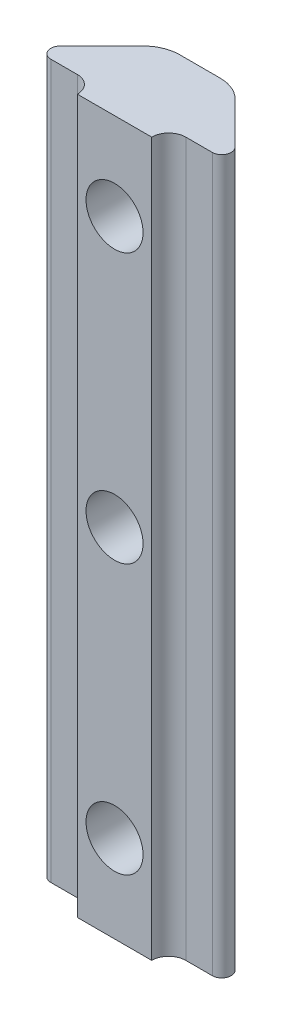
ISO-10303-21;
HEADER;
FILE_DESCRIPTION(('STEP AP214'),'2;1');
FILE_NAME('part.step','',(''),(''),'','','');
FILE_SCHEMA(('AUTOMOTIVE_DESIGN { 1 0 10303 214 1 1 1 1 }'));
ENDSEC;
DATA;
#1=APPLICATION_CONTEXT('core data for automotive mechanical design processes');
#2=APPLICATION_PROTOCOL_DEFINITION('international standard','automotive_design',2000,#1);
#3=PRODUCT_CONTEXT('',#1,'mechanical');
#4=PRODUCT('Part','Part','',(#3));
#5=PRODUCT_RELATED_PRODUCT_CATEGORY('part','',(#4));
#6=PRODUCT_DEFINITION_FORMATION('','',#4);
#7=PRODUCT_DEFINITION_CONTEXT('part definition',#1,'design');
#8=PRODUCT_DEFINITION('design','',#6,#7);
#9=PRODUCT_DEFINITION_SHAPE('','',#8);
#10=(LENGTH_UNIT() NAMED_UNIT(*) SI_UNIT(.MILLI.,.METRE.));
#11=(NAMED_UNIT(*) PLANE_ANGLE_UNIT() SI_UNIT($,.RADIAN.));
#12=(NAMED_UNIT(*) SI_UNIT($,.STERADIAN.) SOLID_ANGLE_UNIT());
#13=UNCERTAINTY_MEASURE_WITH_UNIT(LENGTH_MEASURE(1.E-05),#10,'distance_accuracy_value','');
#14=(GEOMETRIC_REPRESENTATION_CONTEXT(3) GLOBAL_UNCERTAINTY_ASSIGNED_CONTEXT((#13)) GLOBAL_UNIT_ASSIGNED_CONTEXT((#10,
#11,#12)) REPRESENTATION_CONTEXT('',''));
#15=CARTESIAN_POINT('',(0.,0.,0.));
#16=DIRECTION('',(0.,0.,1.));
#17=DIRECTION('',(1.,0.,0.));
#18=AXIS2_PLACEMENT_3D('',#15,#16,#17);
#19=CARTESIAN_POINT('',(-1.61810737439929,57.15,0.));
#20=DIRECTION('',(0.,0.,1.));
#21=DIRECTION('',(1.,0.,0.));
#22=AXIS2_PLACEMENT_3D('',#19,#20,#21);
#23=PLANE('',#22);
#24=DIRECTION('',(0.,-1.,0.));
#25=VECTOR('',#24,1.);
#26=CARTESIAN_POINT('',(1.61810737439929,57.15,0.));
#27=LINE('',#26,#25);
#28=CARTESIAN_POINT('',(1.61810737439929,57.15,0.));
#29=VERTEX_POINT('',#28);
#30=CARTESIAN_POINT('',(1.61810737439929,51.779783120086,0.));
#31=VERTEX_POINT('',#30);
#32=EDGE_CURVE('E188',#29,#31,#27,.T.);
#33=ORIENTED_EDGE('',*,*,#32,.T.);
#34=CARTESIAN_POINT('',(0.,50.165,0.));
#35=DIRECTION('',(0.,0.,1.));
#36=DIRECTION('',(1.,0.,0.));
#37=AXIS2_PLACEMENT_3D('',#34,#35,#36);
#38=CIRCLE('',#37,2.286);
#39=CARTESIAN_POINT('',(-1.61810737439929,51.779783120086,0.));
#40=VERTEX_POINT('',#39);
#41=EDGE_CURVE('E182',#31,#40,#38,.T.);
#42=ORIENTED_EDGE('',*,*,#41,.T.);
#43=DIRECTION('',(0.,-1.,0.));
#44=VECTOR('',#43,1.);
#45=CARTESIAN_POINT('',(-1.61810737439929,57.15,0.));
#46=LINE('',#45,#44);
#47=CARTESIAN_POINT('',(-1.61810737439929,57.15,0.));
#48=VERTEX_POINT('',#47);
#49=EDGE_CURVE('E189',#48,#40,#46,.T.);
#50=ORIENTED_EDGE('',*,*,#49,.F.);
#51=DIRECTION('',(-1.,0.,0.));
#52=VECTOR('',#51,1.);
#53=CARTESIAN_POINT('',(-1.61810737439929,57.15,0.));
#54=LINE('',#53,#52);
#55=EDGE_CURVE('E406',#29,#48,#54,.T.);
#56=ORIENTED_EDGE('',*,*,#55,.F.);
#57=EDGE_LOOP('',(#33,#42,#50,#56));
#58=FACE_BOUND('',#57,.T.);
#59=ADVANCED_FACE('F32',(#58),#23,.F.);
#60=CARTESIAN_POINT('',(-1.61810737439929,48.550216879914,0.));
#61=VERTEX_POINT('',#60);
#62=CARTESIAN_POINT('',(-1.61810737439929,30.189783120086,0.));
#63=VERTEX_POINT('',#62);
#64=EDGE_CURVE('E355',#61,#63,#46,.T.);
#65=ORIENTED_EDGE('',*,*,#64,.F.);
#66=CARTESIAN_POINT('',(1.61810737439929,48.550216879914,0.));
#67=VERTEX_POINT('',#66);
#68=EDGE_CURVE('E363',#61,#67,#38,.T.);
#69=ORIENTED_EDGE('',*,*,#68,.T.);
#70=CARTESIAN_POINT('',(1.61810737439929,30.189783120086,0.));
#71=VERTEX_POINT('',#70);
#72=EDGE_CURVE('E185',#67,#71,#27,.T.);
#73=ORIENTED_EDGE('',*,*,#72,.T.);
#74=CARTESIAN_POINT('',(0.,28.575,0.));
#75=DIRECTION('',(0.,0.,1.));
#76=DIRECTION('',(1.,0.,0.));
#77=AXIS2_PLACEMENT_3D('',#74,#75,#76);
#78=CIRCLE('',#77,2.286);
#79=EDGE_CURVE('E364',#71,#63,#78,.T.);
#80=ORIENTED_EDGE('',*,*,#79,.T.);
#81=EDGE_LOOP('',(#65,#69,#73,#80));
#82=FACE_BOUND('',#81,.T.);
#83=ADVANCED_FACE('F279',(#82),#23,.F.);
#84=CARTESIAN_POINT('',(-1.61810737439929,26.960216879914,0.));
#85=VERTEX_POINT('',#84);
#86=CARTESIAN_POINT('',(-1.61810737439929,8.59978312008598,0.));
#87=VERTEX_POINT('',#86);
#88=EDGE_CURVE('E354',#85,#87,#46,.T.);
#89=ORIENTED_EDGE('',*,*,#88,.F.);
#90=CARTESIAN_POINT('',(1.61810737439929,26.960216879914,0.));
#91=VERTEX_POINT('',#90);
#92=EDGE_CURVE('E61',#85,#91,#78,.T.);
#93=ORIENTED_EDGE('',*,*,#92,.T.);
#94=CARTESIAN_POINT('',(1.61810737439929,8.59978312008599,0.));
#95=VERTEX_POINT('',#94);
#96=EDGE_CURVE('E178',#91,#95,#27,.T.);
#97=ORIENTED_EDGE('',*,*,#96,.T.);
#98=CARTESIAN_POINT('',(0.,6.985,0.));
#99=DIRECTION('',(0.,0.,1.));
#100=DIRECTION('',(1.,0.,0.));
#101=AXIS2_PLACEMENT_3D('',#98,#99,#100);
#102=CIRCLE('',#101,2.286);
#103=EDGE_CURVE('E161',#95,#87,#102,.T.);
#104=ORIENTED_EDGE('',*,*,#103,.T.);
#105=EDGE_LOOP('',(#89,#93,#97,#104));
#106=FACE_BOUND('',#105,.T.);
#107=ADVANCED_FACE('F184',(#106),#23,.F.);
#108=CARTESIAN_POINT('',(-4.34340000000003,57.15,6.83929999999988));
#109=DIRECTION('',(0.,-1.,0.));
#110=DIRECTION('',(0.,0.,-1.));
#111=AXIS2_PLACEMENT_3D('',#108,#109,#110);
#112=CYLINDRICAL_SURFACE('',#111,1.3649);
#113=CARTESIAN_POINT('',(-4.34340000000003,0.,6.83929999999988));
#114=DIRECTION('',(0.,-1.,0.));
#115=DIRECTION('',(0.,0.,1.));
#116=AXIS2_PLACEMENT_3D('',#113,#114,#115);
#117=CIRCLE('',#116,1.3649);
#118=CARTESIAN_POINT('',(-4.34340000000003,0.,5.47439999999988));
#119=VERTEX_POINT('',#118);
#120=CARTESIAN_POINT('',(-2.97850000000003,0.,6.83929999999988));
#121=VERTEX_POINT('',#120);
#122=EDGE_CURVE('E264',#119,#121,#117,.T.);
#123=ORIENTED_EDGE('',*,*,#122,.T.);
#124=DIRECTION('',(0.,-1.,0.));
#125=VECTOR('',#124,1.);
#126=CARTESIAN_POINT('',(-2.97850000000003,57.15,6.83929999999988));
#127=LINE('',#126,#125);
#128=CARTESIAN_POINT('',(-2.97850000000003,57.15,6.83929999999988));
#129=VERTEX_POINT('',#128);
#130=EDGE_CURVE('E209',#129,#121,#127,.T.);
#131=ORIENTED_EDGE('',*,*,#130,.F.);
#132=CARTESIAN_POINT('',(-4.34340000000003,57.15,6.83929999999988));
#133=DIRECTION('',(0.,-1.,0.));
#134=DIRECTION('',(0.,0.,1.));
#135=AXIS2_PLACEMENT_3D('',#132,#133,#134);
#136=CIRCLE('',#135,1.3649);
#137=CARTESIAN_POINT('',(-4.34340000000003,57.15,5.47439999999988));
#138=VERTEX_POINT('',#137);
#139=EDGE_CURVE('E265',#138,#129,#136,.T.);
#140=ORIENTED_EDGE('',*,*,#139,.F.);
#141=DIRECTION('',(0.,-1.,0.));
#142=VECTOR('',#141,1.);
#143=CARTESIAN_POINT('',(-4.34340000000003,57.15,5.47439999999988));
#144=LINE('',#143,#142);
#145=EDGE_CURVE('E310',#138,#119,#144,.T.);
#146=ORIENTED_EDGE('',*,*,#145,.T.);
#147=EDGE_LOOP('',(#123,#131,#140,#146));
#148=FACE_BOUND('',#147,.T.);
#149=ADVANCED_FACE('F34',(#148),#112,.F.);
#150=CARTESIAN_POINT('',(-2.97850000000003,57.15,6.83929999999988));
#151=DIRECTION('',(0.,0.,-1.));
#152=DIRECTION('',(-1.,0.,0.));
#153=AXIS2_PLACEMENT_3D('',#150,#151,#152);
#154=PLANE('',#153);
#155=CARTESIAN_POINT('',(0.,50.165,6.83929999999988));
#156=DIRECTION('',(0.,0.,1.));
#157=DIRECTION('',(1.,0.,0.));
#158=AXIS2_PLACEMENT_3D('',#155,#156,#157);
#159=CIRCLE('',#158,2.286);
#160=CARTESIAN_POINT('',(2.286,50.165,6.83929999999988));
#161=VERTEX_POINT('',#160);
#162=EDGE_CURVE('E365',#161,#161,#159,.T.);
#163=ORIENTED_EDGE('',*,*,#162,.F.);
#164=EDGE_LOOP('',(#163));
#165=FACE_BOUND('',#164,.T.);
#166=CARTESIAN_POINT('',(0.,28.575,6.83929999999988));
#167=DIRECTION('',(0.,0.,1.));
#168=DIRECTION('',(1.,0.,0.));
#169=AXIS2_PLACEMENT_3D('',#166,#167,#168);
#170=CIRCLE('',#169,2.286);
#171=CARTESIAN_POINT('',(2.286,28.575,6.83929999999988));
#172=VERTEX_POINT('',#171);
#173=EDGE_CURVE('E170',#172,#172,#170,.T.);
#174=ORIENTED_EDGE('',*,*,#173,.F.);
#175=EDGE_LOOP('',(#174));
#176=FACE_BOUND('',#175,.T.);
#177=CARTESIAN_POINT('',(0.,6.985,6.83929999999988));
#178=DIRECTION('',(0.,0.,1.));
#179=DIRECTION('',(1.,0.,0.));
#180=AXIS2_PLACEMENT_3D('',#177,#178,#179);
#181=CIRCLE('',#180,2.286);
#182=CARTESIAN_POINT('',(2.286,6.985,6.83929999999988));
#183=VERTEX_POINT('',#182);
#184=EDGE_CURVE('E243',#183,#183,#181,.T.);
#185=ORIENTED_EDGE('',*,*,#184,.F.);
#186=EDGE_LOOP('',(#185));
#187=FACE_BOUND('',#186,.T.);
#188=DIRECTION('',(1.,0.,0.));
#189=VECTOR('',#188,1.);
#190=CARTESIAN_POINT('',(-2.97850000000003,0.,6.83929999999988));
#191=LINE('',#190,#189);
#192=CARTESIAN_POINT('',(2.97849997102827,0.,6.83929999999988));
#193=VERTEX_POINT('',#192);
#194=EDGE_CURVE('E313',#121,#193,#191,.T.);
#195=ORIENTED_EDGE('',*,*,#194,.T.);
#196=DIRECTION('',(0.,-1.,0.));
#197=VECTOR('',#196,1.);
#198=CARTESIAN_POINT('',(2.97849997102827,57.15,6.83929999999988));
#199=LINE('',#198,#197);
#200=CARTESIAN_POINT('',(2.97849997102827,57.15,6.83929999999988));
#201=VERTEX_POINT('',#200);
#202=EDGE_CURVE('E206',#201,#193,#199,.T.);
#203=ORIENTED_EDGE('',*,*,#202,.F.);
#204=DIRECTION('',(1.,0.,0.));
#205=VECTOR('',#204,1.);
#206=CARTESIAN_POINT('',(-2.97850000000003,57.15,6.83929999999988));
#207=LINE('',#206,#205);
#208=EDGE_CURVE('E418',#129,#201,#207,.T.);
#209=ORIENTED_EDGE('',*,*,#208,.F.);
#210=ORIENTED_EDGE('',*,*,#130,.T.);
#211=EDGE_LOOP('',(#195,#203,#209,#210));
#212=FACE_BOUND('',#211,.T.);
#213=ADVANCED_FACE('F297',(#165,#176,#187,#212),#154,.F.);
#214=CARTESIAN_POINT('',(4.34339997102827,57.15,6.83930000000048));
#215=DIRECTION('',(0.,-1.,0.));
#216=DIRECTION('',(0.,0.,-1.));
#217=AXIS2_PLACEMENT_3D('',#214,#215,#216);
#218=CYLINDRICAL_SURFACE('',#217,1.3649);
#219=CARTESIAN_POINT('',(4.34339997102827,0.,6.83930000000048));
#220=DIRECTION('',(0.,-1.,0.));
#221=DIRECTION('',(0.,0.,1.));
#222=AXIS2_PLACEMENT_3D('',#219,#220,#221);
#223=CIRCLE('',#222,1.3649);
#224=CARTESIAN_POINT('',(4.34339997102947,0.,5.47440000000048));
#225=VERTEX_POINT('',#224);
#226=EDGE_CURVE('E315',#193,#225,#223,.T.);
#227=ORIENTED_EDGE('',*,*,#226,.T.);
#228=DIRECTION('',(0.,-1.,0.));
#229=VECTOR('',#228,1.);
#230=CARTESIAN_POINT('',(4.34339997102947,57.15,5.47440000000048));
#231=LINE('',#230,#229);
#232=CARTESIAN_POINT('',(4.34339997102947,57.15,5.47440000000048));
#233=VERTEX_POINT('',#232);
#234=EDGE_CURVE('E203',#233,#225,#231,.T.);
#235=ORIENTED_EDGE('',*,*,#234,.F.);
#236=CARTESIAN_POINT('',(4.34339997102827,57.15,6.83930000000048));
#237=DIRECTION('',(0.,-1.,0.));
#238=DIRECTION('',(0.,0.,1.));
#239=AXIS2_PLACEMENT_3D('',#236,#237,#238);
#240=CIRCLE('',#239,1.3649);
#241=EDGE_CURVE('E382',#201,#233,#240,.T.);
#242=ORIENTED_EDGE('',*,*,#241,.F.);
#243=ORIENTED_EDGE('',*,*,#202,.T.);
#244=EDGE_LOOP('',(#227,#235,#242,#243));
#245=FACE_BOUND('',#244,.T.);
#246=ADVANCED_FACE('F302',(#245),#218,.F.);
#247=CARTESIAN_POINT('',(6.47479445556452,57.15,5.47440000000048));
#248=DIRECTION('',(0.,0.,-1.));
#249=DIRECTION('',(-1.,0.,0.));
#250=AXIS2_PLACEMENT_3D('',#247,#248,#249);
#251=PLANE('',#250);
#252=DIRECTION('',(1.,0.,0.));
#253=VECTOR('',#252,1.);
#254=CARTESIAN_POINT('',(6.47479445556452,0.,5.47440000000048));
#255=LINE('',#254,#253);
#256=CARTESIAN_POINT('',(6.47479445556452,0.,5.47440000000048));
#257=VERTEX_POINT('',#256);
#258=EDGE_CURVE('E322',#225,#257,#255,.T.);
#259=ORIENTED_EDGE('',*,*,#258,.T.);
#260=DIRECTION('',(0.,-1.,0.));
#261=VECTOR('',#260,1.);
#262=CARTESIAN_POINT('',(6.47479445556452,57.15,5.47440000000048));
#263=LINE('',#262,#261);
#264=CARTESIAN_POINT('',(6.47479445556452,57.15,5.47440000000048));
#265=VERTEX_POINT('',#264);
#266=EDGE_CURVE('E200',#265,#257,#263,.T.);
#267=ORIENTED_EDGE('',*,*,#266,.F.);
#268=DIRECTION('',(1.,0.,0.));
#269=VECTOR('',#268,1.);
#270=CARTESIAN_POINT('',(6.47479445556452,57.15,5.47440000000048));
#271=LINE('',#270,#269);
#272=EDGE_CURVE('E398',#233,#265,#271,.T.);
#273=ORIENTED_EDGE('',*,*,#272,.F.);
#274=ORIENTED_EDGE('',*,*,#234,.T.);
#275=EDGE_LOOP('',(#259,#267,#273,#274));
#276=FACE_BOUND('',#275,.T.);
#277=ADVANCED_FACE('F388',(#276),#251,.F.);
#278=CARTESIAN_POINT('',(6.47479445556344,57.15,4.71840000000049));
#279=DIRECTION('',(0.,-1.,0.));
#280=DIRECTION('',(0.,0.,-1.));
#281=AXIS2_PLACEMENT_3D('',#278,#279,#280);
#282=CYLINDRICAL_SURFACE('',#281,0.75599999999999);
#283=CARTESIAN_POINT('',(6.47479445556344,0.,4.71840000000049));
#284=DIRECTION('',(0.,1.,0.));
#285=DIRECTION('',(0.,0.,1.));
#286=AXIS2_PLACEMENT_3D('',#283,#284,#285);
#287=CIRCLE('',#286,0.75599999999999);
#288=CARTESIAN_POINT('',(7.00936718214046,0.,4.18382727342347));
#289=VERTEX_POINT('',#288);
#290=EDGE_CURVE('E324',#257,#289,#287,.T.);
#291=ORIENTED_EDGE('',*,*,#290,.T.);
#292=DIRECTION('',(0.,-1.,0.));
#293=VECTOR('',#292,1.);
#294=CARTESIAN_POINT('',(7.00936718214046,57.15,4.18382727342347));
#295=LINE('',#294,#293);
#296=CARTESIAN_POINT('',(7.00936718214046,57.15,4.18382727342347));
#297=VERTEX_POINT('',#296);
#298=EDGE_CURVE('E197',#297,#289,#295,.T.);
#299=ORIENTED_EDGE('',*,*,#298,.F.);
#300=CARTESIAN_POINT('',(6.47479445556344,57.15,4.71840000000049));
#301=DIRECTION('',(0.,1.,0.));
#302=DIRECTION('',(0.,0.,1.));
#303=AXIS2_PLACEMENT_3D('',#300,#301,#302);
#304=CIRCLE('',#303,0.75599999999999);
#305=EDGE_CURVE('E394',#265,#297,#304,.T.);
#306=ORIENTED_EDGE('',*,*,#305,.F.);
#307=ORIENTED_EDGE('',*,*,#266,.T.);
#308=EDGE_LOOP('',(#291,#299,#306,#307));
#309=FACE_BOUND('',#308,.T.);
#310=ADVANCED_FACE('F392',(#309),#282,.T.);
#311=CARTESIAN_POINT('',(3.67932364155879,57.15,0.853783732841798));
#312=DIRECTION('',(-0.707106781186547,0.,0.707106781186547));
#313=DIRECTION('',(0.707106781186548,0.,0.707106781186547));
#314=AXIS2_PLACEMENT_3D('',#311,#312,#313);
#315=PLANE('',#314);
#316=DIRECTION('',(-0.707106781186548,0.,-0.707106781186547));
#317=VECTOR('',#316,1.);
#318=CARTESIAN_POINT('',(3.67932364155879,0.,0.853783732841798));
#319=LINE('',#318,#317);
#320=CARTESIAN_POINT('',(3.67932364155879,0.,0.853783732841798));
#321=VERTEX_POINT('',#320);
#322=EDGE_CURVE('E326',#289,#321,#319,.T.);
#323=ORIENTED_EDGE('',*,*,#322,.T.);
#324=DIRECTION('',(0.,-1.,0.));
#325=VECTOR('',#324,1.);
#326=CARTESIAN_POINT('',(3.67932364155879,57.15,0.853783732841798));
#327=LINE('',#326,#325);
#328=CARTESIAN_POINT('',(3.67932364155879,57.15,0.853783732841798));
#329=VERTEX_POINT('',#328);
#330=EDGE_CURVE('E193',#329,#321,#327,.T.);
#331=ORIENTED_EDGE('',*,*,#330,.F.);
#332=DIRECTION('',(-0.707106781186548,0.,-0.707106781186547));
#333=VECTOR('',#332,1.);
#334=CARTESIAN_POINT('',(3.67932364155879,57.15,0.853783732841798));
#335=LINE('',#334,#333);
#336=EDGE_CURVE('E397',#297,#329,#335,.T.);
#337=ORIENTED_EDGE('',*,*,#336,.F.);
#338=ORIENTED_EDGE('',*,*,#298,.T.);
#339=EDGE_LOOP('',(#323,#331,#337,#338));
#340=FACE_BOUND('',#339,.T.);
#341=ADVANCED_FACE('F253',(#340),#315,.F.);
#342=CARTESIAN_POINT('',(1.61810737439929,57.15,2.91500000000032));
#343=DIRECTION('',(0.,-1.,0.));
#344=DIRECTION('',(0.,0.,-1.));
#345=AXIS2_PLACEMENT_3D('',#342,#343,#344);
#346=CYLINDRICAL_SURFACE('',#345,2.91500000000032);
#347=ORIENTED_EDGE('',*,*,#72,.F.);
#348=CARTESIAN_POINT('',(1.61810737439929,48.550216879914,0.));
#349=CARTESIAN_POINT('',(1.66323899147256,48.5954398500663,1.30376688067157E-06));
#350=CARTESIAN_POINT('',(1.70644035831713,48.6425253090571,0.00104772380729287));
#351=CARTESIAN_POINT('',(1.78871309622532,48.7400883354525,0.00470547938658288));
#352=CARTESIAN_POINT('',(1.82778618220396,48.7905644799767,0.00731616208996837));
#353=CARTESIAN_POINT('',(1.93837142347236,48.9465095729494,0.0167011248386444));
#354=CARTESIAN_POINT('',(2.00336314909381,49.0566093256093,0.0250309376047432));
#355=CARTESIAN_POINT('',(2.11406447481068,49.2859365890257,0.0419521572884951));
#356=CARTESIAN_POINT('',(2.15978489505486,49.4051589332228,0.0505434145011773));
#357=CARTESIAN_POINT('',(2.23079010094835,49.6496802041116,0.0648828998687394));
#358=CARTESIAN_POINT('',(2.25608516124845,49.774976041962,0.0706325568797527));
#359=CARTESIAN_POINT('',(2.28551377550205,50.0286558991574,0.0773896005165847));
#360=CARTESIAN_POINT('',(2.28956572999911,50.1570499262001,0.0783786995993045));
#361=CARTESIAN_POINT('',(2.27614465445631,50.412684689646,0.0752367686825818));
#362=CARTESIAN_POINT('',(2.25866440231968,50.5399250246675,0.0711040207665049));
#363=CARTESIAN_POINT('',(2.20330105730954,50.7870973945974,0.0592086118449589));
#364=CARTESIAN_POINT('',(2.165815586925,50.9071227789968,0.0515170687171199));
#365=CARTESIAN_POINT('',(2.07175649869404,51.1393173842394,0.03512298252548));
#366=CARTESIAN_POINT('',(2.01519437440964,51.2514912865265,0.0264210502798522));
#367=CARTESIAN_POINT('',(1.90307765639129,51.4346914541526,0.0135827348933205));
#368=CARTESIAN_POINT('',(1.8518235302715,51.508338316434,0.00885190112592733));
#369=CARTESIAN_POINT('',(1.7410198753797,51.6491447055988,0.00206603904521641));
#370=CARTESIAN_POINT('',(1.6814760479127,51.7163086378601,9.18165089105225E-06));
#371=CARTESIAN_POINT('',(1.61810737439929,51.779783120086,0.));
#372=B_SPLINE_CURVE_WITH_KNOTS('',3,(#348,#349,#350,#351,#352,#353,#354,#355,#356,#357,#358,
#359,#360,#361,#362,#363,#364,#365,#366,#367,#368,#369,#370,#371),.UNSPECIFIED.,.F.,.F.,(4,2,2,
2,2,2,2,2,2,2,2,4),(0.,0.191525598870272,0.382971321319337,0.765385988252022,1.14758565609175,
1.52959294451771,1.91306653777625,2.29666878657465,2.67291599255562,3.04893691575237,
3.31787190427621,3.58662283614281),.UNSPECIFIED.);
#373=EDGE_CURVE('E257',#67,#31,#372,.T.);
#374=ORIENTED_EDGE('',*,*,#373,.T.);
#375=ORIENTED_EDGE('',*,*,#32,.F.);
#376=CARTESIAN_POINT('',(1.61810737439929,57.15,2.91500000000032));
#377=DIRECTION('',(0.,1.,0.));
#378=DIRECTION('',(0.,0.,1.));
#379=AXIS2_PLACEMENT_3D('',#376,#377,#378);
#380=CIRCLE('',#379,2.91500000000032);
#381=EDGE_CURVE('E400',#329,#29,#380,.T.);
#382=ORIENTED_EDGE('',*,*,#381,.F.);
#383=ORIENTED_EDGE('',*,*,#330,.T.);
#384=CARTESIAN_POINT('',(1.61810737439929,0.,2.91500000000032));
#385=DIRECTION('',(0.,1.,0.));
#386=DIRECTION('',(0.,0.,1.));
#387=AXIS2_PLACEMENT_3D('',#384,#385,#386);
#388=CIRCLE('',#387,2.91500000000032);
#389=CARTESIAN_POINT('',(1.61810737439929,0.,0.));
#390=VERTEX_POINT('',#389);
#391=EDGE_CURVE('E328',#321,#390,#388,.T.);
#392=ORIENTED_EDGE('',*,*,#391,.T.);
#393=CARTESIAN_POINT('',(1.61810737439929,5.37021687991401,0.));
#394=VERTEX_POINT('',#393);
#395=EDGE_CURVE('E180',#394,#390,#27,.T.);
#396=ORIENTED_EDGE('',*,*,#395,.F.);
#397=CARTESIAN_POINT('',(1.61810737439929,5.37021687991401,0.));
#398=CARTESIAN_POINT('',(1.66323899147255,5.41543985006633,1.30376688059274E-06));
#399=CARTESIAN_POINT('',(1.70644035831713,5.46252530905708,0.00104772380729283));
#400=CARTESIAN_POINT('',(1.78871309622532,5.56008833545248,0.004705479386583));
#401=CARTESIAN_POINT('',(1.82778618220396,5.6105644799767,0.00731616208996859));
#402=CARTESIAN_POINT('',(1.93837142347236,5.76650957294943,0.0167011248386449));
#403=CARTESIAN_POINT('',(2.00336314909381,5.87660932560932,0.0250309376047438));
#404=CARTESIAN_POINT('',(2.11406447481069,6.10593658902569,0.0419521572884958));
#405=CARTESIAN_POINT('',(2.15978489505487,6.22515893322278,0.0505434145011778));
#406=CARTESIAN_POINT('',(2.23079010094835,6.4696802041116,0.06488289986874));
#407=CARTESIAN_POINT('',(2.25608516124845,6.59497604196199,0.0706325568797535));
#408=CARTESIAN_POINT('',(2.28551377550205,6.84865589915738,0.077389600516586));
#409=CARTESIAN_POINT('',(2.28956572999911,6.97704992620009,0.0783786995993061));
#410=CARTESIAN_POINT('',(2.27614465445632,7.23268468964594,0.075236768682584));
#411=CARTESIAN_POINT('',(2.25866440231969,7.35992502466753,0.071104020766507));
#412=CARTESIAN_POINT('',(2.20330105730955,7.6070973945974,0.0592086118449605));
#413=CARTESIAN_POINT('',(2.16581558692501,7.72712277899679,0.0515170687171214));
#414=CARTESIAN_POINT('',(2.07175649869405,7.95931738423941,0.0351229825254816));
#415=CARTESIAN_POINT('',(2.01519437440965,8.0714912865265,0.0264210502798539));
#416=CARTESIAN_POINT('',(1.9030776563913,8.25469145415261,0.0135827348933219));
#417=CARTESIAN_POINT('',(1.85182353027151,8.32833831643398,0.00885190112592846));
#418=CARTESIAN_POINT('',(1.74101987537971,8.46914470559883,0.00206603904521694));
#419=CARTESIAN_POINT('',(1.68147604791271,8.53630863786007,9.18165089123966E-06));
#420=CARTESIAN_POINT('',(1.6181073743993,8.59978312008599,0.));
#421=B_SPLINE_CURVE_WITH_KNOTS('',3,(#397,#398,#399,#400,#401,#402,#403,#404,#405,#406,#407,
#408,#409,#410,#411,#412,#413,#414,#415,#416,#417,#418,#419,#420),.UNSPECIFIED.,.F.,.F.,(4,2,2,
2,2,2,2,2,2,2,2,4),(0.,0.191525598870274,0.382971321319339,0.765385988252022,1.14758565609175,
1.52959294451771,1.91306653777624,2.29666878657465,2.67291599255562,3.04893691575237,
3.31787190427622,3.58662283614282),.UNSPECIFIED.);
#422=EDGE_CURVE('E164',#394,#95,#421,.T.);
#423=ORIENTED_EDGE('',*,*,#422,.T.);
#424=ORIENTED_EDGE('',*,*,#96,.F.);
#425=CARTESIAN_POINT('',(1.61810737439929,26.960216879914,0.));
#426=CARTESIAN_POINT('',(1.66323899147256,27.0054398500663,1.30376688073227E-06));
#427=CARTESIAN_POINT('',(1.70644035831713,27.0525253090571,0.00104772380729298));
#428=CARTESIAN_POINT('',(1.78871309622532,27.1500883354525,0.00470547938658307));
#429=CARTESIAN_POINT('',(1.82778618220397,27.2005644799767,0.0073161620899686));
#430=CARTESIAN_POINT('',(1.93837142347236,27.3565095729494,0.0167011248386447));
#431=CARTESIAN_POINT('',(2.00336314909381,27.4666093256093,0.0250309376047434));
#432=CARTESIAN_POINT('',(2.11406447481069,27.6959365890257,0.0419521572884953));
#433=CARTESIAN_POINT('',(2.15978489505487,27.8151589332228,0.0505434145011776));
#434=CARTESIAN_POINT('',(2.23079010094835,28.0596802041116,0.0648828998687397));
#435=CARTESIAN_POINT('',(2.25608516124845,28.184976041962,0.0706325568797529));
#436=CARTESIAN_POINT('',(2.28551377550205,28.4386558991574,0.0773896005165847));
#437=CARTESIAN_POINT('',(2.28956572999911,28.5670499262001,0.0783786995993044));
#438=CARTESIAN_POINT('',(2.27614465445631,28.8226846896459,0.0752367686825824));
#439=CARTESIAN_POINT('',(2.25866440231968,28.9499250246675,0.0711040207665061));
#440=CARTESIAN_POINT('',(2.20330105730954,29.1970973945974,0.0592086118449597));
#441=CARTESIAN_POINT('',(2.165815586925,29.3171227789968,0.0515170687171198));
#442=CARTESIAN_POINT('',(2.07175649869404,29.5493173842394,0.0351229825254799));
#443=CARTESIAN_POINT('',(2.01519437440964,29.6614912865265,0.0264210502798529));
#444=CARTESIAN_POINT('',(1.90307765639129,29.8446914541526,0.0135827348933215));
#445=CARTESIAN_POINT('',(1.8518235302715,29.918338316434,0.00885190112592821));
#446=CARTESIAN_POINT('',(1.7410198753797,30.0591447055988,0.00206603904521662));
#447=CARTESIAN_POINT('',(1.68147604791271,30.1263086378601,9.18165089081968E-06));
#448=CARTESIAN_POINT('',(1.61810737439929,30.189783120086,0.));
#449=B_SPLINE_CURVE_WITH_KNOTS('',3,(#425,#426,#427,#428,#429,#430,#431,#432,#433,#434,#435,
#436,#437,#438,#439,#440,#441,#442,#443,#444,#445,#446,#447,#448),.UNSPECIFIED.,.F.,.F.,(4,2,2,
2,2,2,2,2,2,2,2,4),(0.,0.191525598870273,0.382971321319339,0.765385988252021,1.14758565609175,
1.52959294451771,1.91306653777623,2.29666878657464,2.67291599255561,3.04893691575237,
3.3178719042762,3.5866228361428),.UNSPECIFIED.);
#450=EDGE_CURVE('E181',#91,#71,#449,.T.);
#451=ORIENTED_EDGE('',*,*,#450,.T.);
#452=EDGE_LOOP('',(#347,#374,#375,#382,#383,#392,#396,#423,#424,#451));
#453=FACE_BOUND('',#452,.T.);
#454=ADVANCED_FACE('F176',(#453),#346,.T.);
#455=CARTESIAN_POINT('',(-1.61810737439929,5.37021687991402,0.));
#456=VERTEX_POINT('',#455);
#457=CARTESIAN_POINT('',(-1.61810737439929,0.,0.));
#458=VERTEX_POINT('',#457);
#459=EDGE_CURVE('E349',#456,#458,#46,.T.);
#460=ORIENTED_EDGE('',*,*,#459,.F.);
#461=EDGE_CURVE('E53',#456,#394,#102,.T.);
#462=ORIENTED_EDGE('',*,*,#461,.T.);
#463=ORIENTED_EDGE('',*,*,#395,.T.);
#464=DIRECTION('',(-1.,0.,0.));
#465=VECTOR('',#464,1.);
#466=CARTESIAN_POINT('',(-1.61810737439929,0.,0.));
#467=LINE('',#466,#465);
#468=EDGE_CURVE('E330',#390,#458,#467,.T.);
#469=ORIENTED_EDGE('',*,*,#468,.T.);
#470=EDGE_LOOP('',(#460,#462,#463,#469));
#471=FACE_BOUND('',#470,.T.);
#472=ADVANCED_FACE('F252',(#471),#23,.F.);
#473=CARTESIAN_POINT('',(-1.61810737439929,57.15,2.9150000000003));
#474=DIRECTION('',(0.,-1.,0.));
#475=DIRECTION('',(0.,0.,-1.));
#476=AXIS2_PLACEMENT_3D('',#473,#474,#475);
#477=CYLINDRICAL_SURFACE('',#476,2.9150000000003);
#478=ORIENTED_EDGE('',*,*,#49,.T.);
#479=CARTESIAN_POINT('',(-1.61810737439929,51.779783120086,0.));
#480=CARTESIAN_POINT('',(-1.66323899147256,51.7345601499337,1.30376688141757E-06));
#481=CARTESIAN_POINT('',(-1.70644035831713,51.6874746909429,0.00104772380729365));
#482=CARTESIAN_POINT('',(-1.78871309622532,51.5899116645475,0.00470547938658355));
#483=CARTESIAN_POINT('',(-1.82778618220397,51.5394355200233,0.00731616208996891));
#484=CARTESIAN_POINT('',(-1.93837142347236,51.3834904270506,0.0167011248386449));
#485=CARTESIAN_POINT('',(-2.00336314909381,51.2733906743907,0.0250309376047442));
#486=CARTESIAN_POINT('',(-2.11406447481069,51.0440634109743,0.0419521572884968));
#487=CARTESIAN_POINT('',(-2.15978489505487,50.9248410667772,0.0505434145011792));
#488=CARTESIAN_POINT('',(-2.23079010094835,50.6803197958884,0.0648828998687412));
#489=CARTESIAN_POINT('',(-2.25608516124845,50.555023958038,0.0706325568797543));
#490=CARTESIAN_POINT('',(-2.28551377550205,50.3013441008426,0.0773896005165863));
#491=CARTESIAN_POINT('',(-2.28956572999911,50.1729500737999,0.0783786995993062));
#492=CARTESIAN_POINT('',(-2.27614465445632,49.917315310354,0.0752367686825837));
#493=CARTESIAN_POINT('',(-2.25866440231968,49.7900749753325,0.0711040207665068));
#494=CARTESIAN_POINT('',(-2.20330105730955,49.5429026054026,0.0592086118449604));
#495=CARTESIAN_POINT('',(-2.165815586925,49.4228772210032,0.0515170687171213));
#496=CARTESIAN_POINT('',(-2.07175649869405,49.1906826157606,0.0351229825254814));
#497=CARTESIAN_POINT('',(-2.01519437440965,49.0785087134735,0.0264210502798538));
#498=CARTESIAN_POINT('',(-1.9030776563913,48.8953085458474,0.013582734893322));
#499=CARTESIAN_POINT('',(-1.8518235302715,48.821661683566,0.00885190112592866));
#500=CARTESIAN_POINT('',(-1.74101987537971,48.6808552944012,0.00206603904521714));
#501=CARTESIAN_POINT('',(-1.68147604791271,48.6136913621399,9.18165089145836E-06));
#502=CARTESIAN_POINT('',(-1.6181073743993,48.550216879914,0.));
#503=B_SPLINE_CURVE_WITH_KNOTS('',3,(#479,#480,#481,#482,#483,#484,#485,#486,#487,#488,#489,
#490,#491,#492,#493,#494,#495,#496,#497,#498,#499,#500,#501,#502),.UNSPECIFIED.,.F.,.F.,(4,2,2,
2,2,2,2,2,2,2,2,4),(0.,0.191525598870274,0.382971321319339,0.765385988252024,1.14758565609176,
1.52959294451772,1.91306653777624,2.29666878657465,2.67291599255561,3.04893691575236,
3.3178719042762,3.58662283614281),.UNSPECIFIED.);
#504=EDGE_CURVE('E11',#40,#61,#503,.T.);
#505=ORIENTED_EDGE('',*,*,#504,.T.);
#506=ORIENTED_EDGE('',*,*,#64,.T.);
#507=CARTESIAN_POINT('',(-1.61810737439929,30.189783120086,0.));
#508=CARTESIAN_POINT('',(-1.66323899147256,30.1445601499337,1.30376688049172E-06));
#509=CARTESIAN_POINT('',(-1.70644035831713,30.0974746909429,0.00104772380729275));
#510=CARTESIAN_POINT('',(-1.78871309622532,29.9999116645475,0.00470547938658328));
#511=CARTESIAN_POINT('',(-1.82778618220397,29.9494355200233,0.00731616208996925));
#512=CARTESIAN_POINT('',(-1.93837142347236,29.7934904270506,0.0167011248386459));
#513=CARTESIAN_POINT('',(-2.00336314909381,29.6833906743907,0.0250309376047441));
#514=CARTESIAN_POINT('',(-2.11406447481069,29.4540634109743,0.0419521572884958));
#515=CARTESIAN_POINT('',(-2.15978489505487,29.3348410667772,0.0505434145011783));
#516=CARTESIAN_POINT('',(-2.23079010094835,29.0903197958884,0.0648828998687406));
#517=CARTESIAN_POINT('',(-2.25608516124845,28.965023958038,0.0706325568797537));
#518=CARTESIAN_POINT('',(-2.28551377550205,28.7113441008426,0.0773896005165857));
#519=CARTESIAN_POINT('',(-2.28956572999911,28.5829500737999,0.0783786995993058));
#520=CARTESIAN_POINT('',(-2.27614465445632,28.3273153103541,0.0752367686825836));
#521=CARTESIAN_POINT('',(-2.25866440231968,28.2000749753325,0.0711040207665064));
#522=CARTESIAN_POINT('',(-2.20330105730955,27.9529026054026,0.0592086118449602));
#523=CARTESIAN_POINT('',(-2.165815586925,27.8328772210032,0.0515170687171215));
#524=CARTESIAN_POINT('',(-2.07175649869405,27.6006826157606,0.0351229825254816));
#525=CARTESIAN_POINT('',(-2.01519437440965,27.4885087134735,0.0264210502798535));
#526=CARTESIAN_POINT('',(-1.90307765639129,27.3053085458474,0.0135827348933214));
#527=CARTESIAN_POINT('',(-1.8518235302715,27.231661683566,0.00885190112592821));
#528=CARTESIAN_POINT('',(-1.74101987537971,27.0908552944012,0.00206603904521704));
#529=CARTESIAN_POINT('',(-1.68147604791271,27.0236913621399,9.18165089150745E-06));
#530=CARTESIAN_POINT('',(-1.6181073743993,26.960216879914,0.));
#531=B_SPLINE_CURVE_WITH_KNOTS('',3,(#507,#508,#509,#510,#511,#512,#513,#514,#515,#516,#517,
#518,#519,#520,#521,#522,#523,#524,#525,#526,#527,#528,#529,#530),.UNSPECIFIED.,.F.,.F.,(4,2,2,
2,2,2,2,2,2,2,2,4),(0.,0.191525598870273,0.382971321319339,0.765385988252021,1.14758565609175,
1.52959294451771,1.91306653777623,2.29666878657465,2.67291599255562,3.04893691575237,
3.31787190427621,3.58662283614281),.UNSPECIFIED.);
#532=EDGE_CURVE('E46',#63,#85,#531,.T.);
#533=ORIENTED_EDGE('',*,*,#532,.T.);
#534=ORIENTED_EDGE('',*,*,#88,.T.);
#535=CARTESIAN_POINT('',(-1.61810737439929,8.59978312008598,0.));
#536=CARTESIAN_POINT('',(-1.66323899147256,8.55456014993366,1.30376688110039E-06));
#537=CARTESIAN_POINT('',(-1.70644035831713,8.50747469094291,0.00104772380729332));
#538=CARTESIAN_POINT('',(-1.78871309622532,8.40991166454751,0.00470547938658335));
#539=CARTESIAN_POINT('',(-1.82778618220397,8.35943552002329,0.00731616208996884));
#540=CARTESIAN_POINT('',(-1.93837142347236,8.20349042705056,0.0167011248386449));
#541=CARTESIAN_POINT('',(-2.00336314909381,8.09339067439067,0.0250309376047436));
#542=CARTESIAN_POINT('',(-2.11406447481069,7.8640634109743,0.0419521572884959));
#543=CARTESIAN_POINT('',(-2.15978489505486,7.7448410667772,0.0505434145011785));
#544=CARTESIAN_POINT('',(-2.23079010094835,7.50031979588839,0.0648828998687402));
#545=CARTESIAN_POINT('',(-2.25608516124845,7.375023958038,0.0706325568797527));
#546=CARTESIAN_POINT('',(-2.28551377550204,7.1213441008426,0.0773896005165846));
#547=CARTESIAN_POINT('',(-2.2895657299991,6.9929500737999,0.0783786995993052));
#548=CARTESIAN_POINT('',(-2.27614465445631,6.73731531035405,0.0752367686825832));
#549=CARTESIAN_POINT('',(-2.25866440231967,6.61007497533246,0.0711040207665058));
#550=CARTESIAN_POINT('',(-2.20330105730954,6.36290260540259,0.0592086118449588));
#551=CARTESIAN_POINT('',(-2.16581558692499,6.24287722100319,0.0515170687171194));
#552=CARTESIAN_POINT('',(-2.07175649869404,6.01068261576058,0.0351229825254797));
#553=CARTESIAN_POINT('',(-2.01519437440964,5.89850871347349,0.0264210502798525));
#554=CARTESIAN_POINT('',(-1.90307765639128,5.71530854584738,0.0135827348933211));
#555=CARTESIAN_POINT('',(-1.85182353027149,5.64166168356602,0.00885190112592796));
#556=CARTESIAN_POINT('',(-1.7410198753797,5.50085529440118,0.00206603904521687));
#557=CARTESIAN_POINT('',(-1.6814760479127,5.43369136213994,9.18165089137183E-06));
#558=CARTESIAN_POINT('',(-1.61810737439929,5.37021687991402,0.));
#559=B_SPLINE_CURVE_WITH_KNOTS('',3,(#535,#536,#537,#538,#539,#540,#541,#542,#543,#544,#545,
#546,#547,#548,#549,#550,#551,#552,#553,#554,#555,#556,#557,#558),.UNSPECIFIED.,.F.,.F.,(4,2,2,
2,2,2,2,2,2,2,2,4),(0.,0.191525598870274,0.382971321319338,0.765385988252022,1.14758565609175,
1.52959294451771,1.91306653777623,2.29666878657464,2.67291599255562,3.04893691575237,
3.3178719042762,3.5866228361428),.UNSPECIFIED.);
#560=EDGE_CURVE('E165',#87,#456,#559,.T.);
#561=ORIENTED_EDGE('',*,*,#560,.T.);
#562=ORIENTED_EDGE('',*,*,#459,.T.);
#563=CARTESIAN_POINT('',(-1.61810737439929,0.,2.9150000000003));
#564=DIRECTION('',(0.,1.,0.));
#565=DIRECTION('',(0.,0.,1.));
#566=AXIS2_PLACEMENT_3D('',#563,#564,#565);
#567=CIRCLE('',#566,2.9150000000003);
#568=CARTESIAN_POINT('',(-3.67932364155829,0.,0.853783732841303));
#569=VERTEX_POINT('',#568);
#570=EDGE_CURVE('E333',#458,#569,#567,.T.);
#571=ORIENTED_EDGE('',*,*,#570,.T.);
#572=DIRECTION('',(0.,-1.,0.));
#573=VECTOR('',#572,1.);
#574=CARTESIAN_POINT('',(-3.67932364155829,57.15,0.853783732841303));
#575=LINE('',#574,#573);
#576=CARTESIAN_POINT('',(-3.67932364155829,57.15,0.853783732841303));
#577=VERTEX_POINT('',#576);
#578=EDGE_CURVE('E347',#577,#569,#575,.T.);
#579=ORIENTED_EDGE('',*,*,#578,.F.);
#580=CARTESIAN_POINT('',(-1.61810737439929,57.15,2.9150000000003));
#581=DIRECTION('',(0.,1.,0.));
#582=DIRECTION('',(0.,0.,1.));
#583=AXIS2_PLACEMENT_3D('',#580,#581,#582);
#584=CIRCLE('',#583,2.9150000000003);
#585=EDGE_CURVE('E408',#48,#577,#584,.T.);
#586=ORIENTED_EDGE('',*,*,#585,.F.);
#587=EDGE_LOOP('',(#478,#505,#506,#533,#534,#561,#562,#571,#579,#586));
#588=FACE_BOUND('',#587,.T.);
#589=ADVANCED_FACE('F222',(#588),#477,.T.);
#590=CARTESIAN_POINT('',(-7.00936718213991,57.15,4.18382727342292));
#591=DIRECTION('',(0.707106781186547,0.,0.707106781186547));
#592=DIRECTION('',(0.707106781186547,0.,-0.707106781186548));
#593=AXIS2_PLACEMENT_3D('',#590,#591,#592);
#594=PLANE('',#593);
#595=DIRECTION('',(-0.707106781186547,0.,0.707106781186548));
#596=VECTOR('',#595,1.);
#597=CARTESIAN_POINT('',(-7.00936718213991,0.,4.18382727342292));
#598=LINE('',#597,#596);
#599=CARTESIAN_POINT('',(-7.00936718213991,0.,4.18382727342292));
#600=VERTEX_POINT('',#599);
#601=EDGE_CURVE('E335',#569,#600,#598,.T.);
#602=ORIENTED_EDGE('',*,*,#601,.T.);
#603=DIRECTION('',(0.,-1.,0.));
#604=VECTOR('',#603,1.);
#605=CARTESIAN_POINT('',(-7.00936718213991,57.15,4.18382727342292));
#606=LINE('',#605,#604);
#607=CARTESIAN_POINT('',(-7.00936718213991,57.15,4.18382727342292));
#608=VERTEX_POINT('',#607);
#609=EDGE_CURVE('E345',#608,#600,#606,.T.);
#610=ORIENTED_EDGE('',*,*,#609,.F.);
#611=DIRECTION('',(-0.707106781186547,0.,0.707106781186548));
#612=VECTOR('',#611,1.);
#613=CARTESIAN_POINT('',(-7.00936718213991,57.15,4.18382727342292));
#614=LINE('',#613,#612);
#615=EDGE_CURVE('E410',#577,#608,#614,.T.);
#616=ORIENTED_EDGE('',*,*,#615,.F.);
#617=ORIENTED_EDGE('',*,*,#578,.T.);
#618=EDGE_LOOP('',(#602,#610,#616,#617));
#619=FACE_BOUND('',#618,.T.);
#620=ADVANCED_FACE('F290',(#619),#594,.F.);
#621=CARTESIAN_POINT('',(-6.47479445556298,57.15,4.71839999999995));
#622=DIRECTION('',(0.,-1.,0.));
#623=DIRECTION('',(0.,0.,-1.));
#624=AXIS2_PLACEMENT_3D('',#621,#622,#623);
#625=CYLINDRICAL_SURFACE('',#624,0.755999999999928);
#626=CARTESIAN_POINT('',(-6.47479445556298,0.,4.71839999999995));
#627=DIRECTION('',(0.,1.,0.));
#628=DIRECTION('',(0.,0.,1.));
#629=AXIS2_PLACEMENT_3D('',#626,#627,#628);
#630=CIRCLE('',#629,0.755999999999928);
#631=CARTESIAN_POINT('',(-6.47479445556298,0.,5.47439999999988));
#632=VERTEX_POINT('',#631);
#633=EDGE_CURVE('E337',#600,#632,#630,.T.);
#634=ORIENTED_EDGE('',*,*,#633,.T.);
#635=DIRECTION('',(0.,-1.,0.));
#636=VECTOR('',#635,1.);
#637=CARTESIAN_POINT('',(-6.47479445556298,57.15,5.47439999999988));
#638=LINE('',#637,#636);
#639=CARTESIAN_POINT('',(-6.47479445556298,57.15,5.47439999999988));
#640=VERTEX_POINT('',#639);
#641=EDGE_CURVE('E342',#640,#632,#638,.T.);
#642=ORIENTED_EDGE('',*,*,#641,.F.);
#643=CARTESIAN_POINT('',(-6.47479445556298,57.15,4.71839999999995));
#644=DIRECTION('',(0.,1.,0.));
#645=DIRECTION('',(0.,0.,1.));
#646=AXIS2_PLACEMENT_3D('',#643,#644,#645);
#647=CIRCLE('',#646,0.755999999999928);
#648=EDGE_CURVE('E411',#608,#640,#647,.T.);
#649=ORIENTED_EDGE('',*,*,#648,.F.);
#650=ORIENTED_EDGE('',*,*,#609,.T.);
#651=EDGE_LOOP('',(#634,#642,#649,#650));
#652=FACE_BOUND('',#651,.T.);
#653=ADVANCED_FACE('F422',(#652),#625,.T.);
#654=CARTESIAN_POINT('',(-4.34340000000003,57.15,5.47439999999988));
#655=DIRECTION('',(0.,0.,-1.));
#656=DIRECTION('',(-1.,0.,0.));
#657=AXIS2_PLACEMENT_3D('',#654,#655,#656);
#658=PLANE('',#657);
#659=DIRECTION('',(1.,0.,0.));
#660=VECTOR('',#659,1.);
#661=CARTESIAN_POINT('',(-4.34340000000003,0.,5.47439999999988));
#662=LINE('',#661,#660);
#663=EDGE_CURVE('E339',#632,#119,#662,.T.);
#664=ORIENTED_EDGE('',*,*,#663,.T.);
#665=ORIENTED_EDGE('',*,*,#145,.F.);
#666=DIRECTION('',(1.,0.,0.));
#667=VECTOR('',#666,1.);
#668=CARTESIAN_POINT('',(-4.34340000000003,57.15,5.47439999999988));
#669=LINE('',#668,#667);
#670=EDGE_CURVE('E318',#640,#138,#669,.T.);
#671=ORIENTED_EDGE('',*,*,#670,.F.);
#672=ORIENTED_EDGE('',*,*,#641,.T.);
#673=EDGE_LOOP('',(#664,#665,#671,#672));
#674=FACE_BOUND('',#673,.T.);
#675=ADVANCED_FACE('F417',(#674),#658,.F.);
#676=CARTESIAN_POINT('',(-4.34340000000003,57.15,6.83929999999988));
#677=DIRECTION('',(0.,1.,0.));
#678=DIRECTION('',(0.,0.,1.));
#679=AXIS2_PLACEMENT_3D('',#676,#677,#678);
#680=PLANE('',#679);
#681=ORIENTED_EDGE('',*,*,#139,.T.);
#682=ORIENTED_EDGE('',*,*,#208,.T.);
#683=ORIENTED_EDGE('',*,*,#241,.T.);
#684=ORIENTED_EDGE('',*,*,#272,.T.);
#685=ORIENTED_EDGE('',*,*,#305,.T.);
#686=ORIENTED_EDGE('',*,*,#336,.T.);
#687=ORIENTED_EDGE('',*,*,#381,.T.);
#688=ORIENTED_EDGE('',*,*,#55,.T.);
#689=ORIENTED_EDGE('',*,*,#585,.T.);
#690=ORIENTED_EDGE('',*,*,#615,.T.);
#691=ORIENTED_EDGE('',*,*,#648,.T.);
#692=ORIENTED_EDGE('',*,*,#670,.T.);
#693=EDGE_LOOP('',(#681,#682,#683,#684,#685,#686,#687,#688,#689,#690,#691,#692));
#694=FACE_BOUND('',#693,.T.);
#695=ADVANCED_FACE('F233',(#694),#680,.T.);
#696=CARTESIAN_POINT('',(-4.34340000000003,0.,6.83929999999988));
#697=DIRECTION('',(0.,1.,0.));
#698=DIRECTION('',(0.,0.,1.));
#699=AXIS2_PLACEMENT_3D('',#696,#697,#698);
#700=PLANE('',#699);
#701=ORIENTED_EDGE('',*,*,#122,.F.);
#702=ORIENTED_EDGE('',*,*,#663,.F.);
#703=ORIENTED_EDGE('',*,*,#633,.F.);
#704=ORIENTED_EDGE('',*,*,#601,.F.);
#705=ORIENTED_EDGE('',*,*,#570,.F.);
#706=ORIENTED_EDGE('',*,*,#468,.F.);
#707=ORIENTED_EDGE('',*,*,#391,.F.);
#708=ORIENTED_EDGE('',*,*,#322,.F.);
#709=ORIENTED_EDGE('',*,*,#290,.F.);
#710=ORIENTED_EDGE('',*,*,#258,.F.);
#711=ORIENTED_EDGE('',*,*,#226,.F.);
#712=ORIENTED_EDGE('',*,*,#194,.F.);
#713=EDGE_LOOP('',(#701,#702,#703,#704,#705,#706,#707,#708,#709,#710,#711,#712));
#714=FACE_BOUND('',#713,.T.);
#715=ADVANCED_FACE('F230',(#714),#700,.F.);
#716=CARTESIAN_POINT('',(0.,6.985,0.));
#717=DIRECTION('',(0.,0.,1.));
#718=DIRECTION('',(1.,0.,0.));
#719=AXIS2_PLACEMENT_3D('',#716,#717,#718);
#720=CYLINDRICAL_SURFACE('',#719,2.286);
#721=ORIENTED_EDGE('',*,*,#184,.T.);
#722=EDGE_LOOP('',(#721));
#723=FACE_BOUND('',#722,.T.);
#724=ORIENTED_EDGE('',*,*,#461,.F.);
#725=ORIENTED_EDGE('',*,*,#560,.F.);
#726=ORIENTED_EDGE('',*,*,#103,.F.);
#727=ORIENTED_EDGE('',*,*,#422,.F.);
#728=EDGE_LOOP('',(#724,#725,#726,#727));
#729=FACE_BOUND('',#728,.T.);
#730=ADVANCED_FACE('F163',(#723,#729),#720,.F.);
#731=CARTESIAN_POINT('',(0.,28.575,0.));
#732=DIRECTION('',(0.,0.,1.));
#733=DIRECTION('',(1.,0.,0.));
#734=AXIS2_PLACEMENT_3D('',#731,#732,#733);
#735=CYLINDRICAL_SURFACE('',#734,2.286);
#736=ORIENTED_EDGE('',*,*,#173,.T.);
#737=EDGE_LOOP('',(#736));
#738=FACE_BOUND('',#737,.T.);
#739=ORIENTED_EDGE('',*,*,#92,.F.);
#740=ORIENTED_EDGE('',*,*,#532,.F.);
#741=ORIENTED_EDGE('',*,*,#79,.F.);
#742=ORIENTED_EDGE('',*,*,#450,.F.);
#743=EDGE_LOOP('',(#739,#740,#741,#742));
#744=FACE_BOUND('',#743,.T.);
#745=ADVANCED_FACE('F229',(#738,#744),#735,.F.);
#746=CARTESIAN_POINT('',(0.,50.165,0.));
#747=DIRECTION('',(0.,0.,1.));
#748=DIRECTION('',(1.,0.,0.));
#749=AXIS2_PLACEMENT_3D('',#746,#747,#748);
#750=CYLINDRICAL_SURFACE('',#749,2.286);
#751=ORIENTED_EDGE('',*,*,#162,.T.);
#752=EDGE_LOOP('',(#751));
#753=FACE_BOUND('',#752,.T.);
#754=ORIENTED_EDGE('',*,*,#68,.F.);
#755=ORIENTED_EDGE('',*,*,#504,.F.);
#756=ORIENTED_EDGE('',*,*,#41,.F.);
#757=ORIENTED_EDGE('',*,*,#373,.F.);
#758=EDGE_LOOP('',(#754,#755,#756,#757));
#759=FACE_BOUND('',#758,.T.);
#760=ADVANCED_FACE('F267',(#753,#759),#750,.F.);
#761=CLOSED_SHELL('',(#59,#83,#107,#149,#213,#246,#277,#310,#341,#454,#472,#589,#620,#653,#675,
#695,#715,#730,#745,#760));
#762=MANIFOLD_SOLID_BREP('B2',#761);
#763=ADVANCED_BREP_SHAPE_REPRESENTATION('',(#18,#762),#14);
#764=SHAPE_DEFINITION_REPRESENTATION(#9,#763);
ENDSEC;
END-ISO-10303-21;
